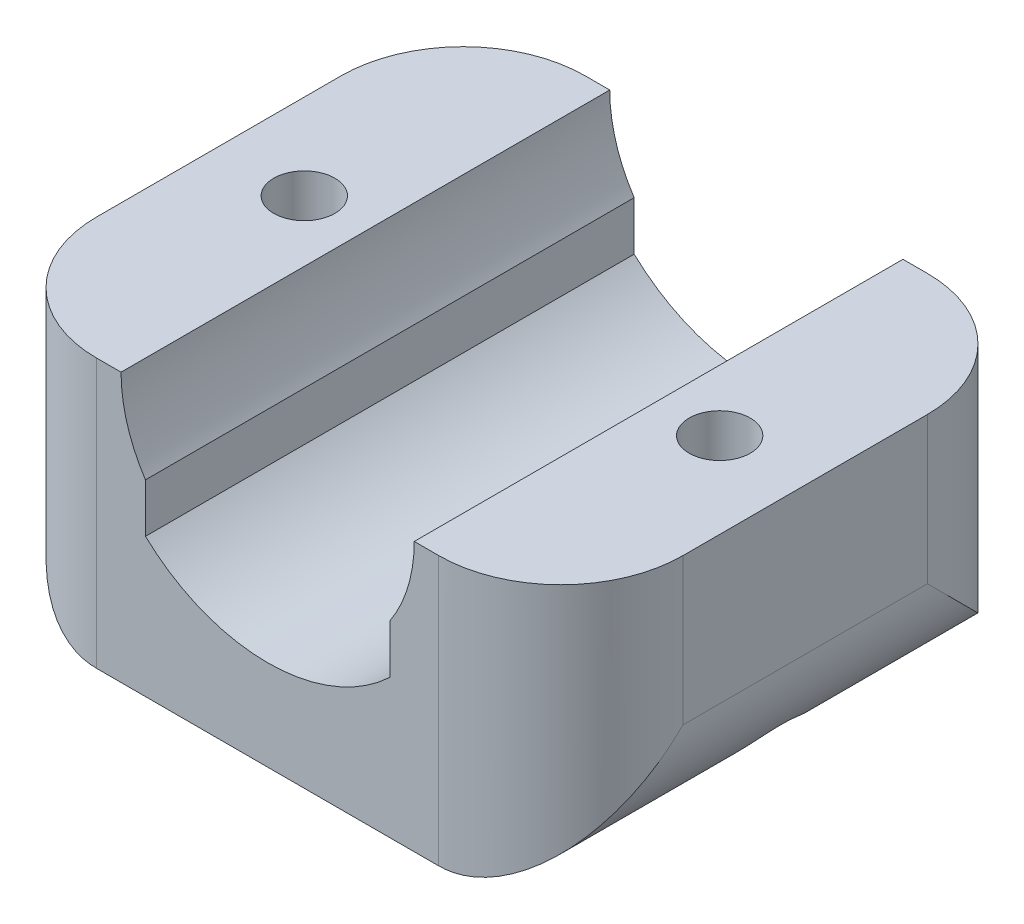
ISO-10303-21;
HEADER;
FILE_DESCRIPTION(('STEP AP214'),'2;1');
FILE_NAME('part.step','',(''),(''),'','','');
FILE_SCHEMA(('AUTOMOTIVE_DESIGN { 1 0 10303 214 1 1 1 1 }'));
ENDSEC;
DATA;
#1=APPLICATION_CONTEXT('core data for automotive mechanical design processes');
#2=APPLICATION_PROTOCOL_DEFINITION('international standard','automotive_design',2000,#1);
#3=PRODUCT_CONTEXT('',#1,'mechanical');
#4=PRODUCT('Part','Part','',(#3));
#5=PRODUCT_RELATED_PRODUCT_CATEGORY('part','',(#4));
#6=PRODUCT_DEFINITION_FORMATION('','',#4);
#7=PRODUCT_DEFINITION_CONTEXT('part definition',#1,'design');
#8=PRODUCT_DEFINITION('design','',#6,#7);
#9=PRODUCT_DEFINITION_SHAPE('','',#8);
#10=(LENGTH_UNIT() NAMED_UNIT(*) SI_UNIT(.MILLI.,.METRE.));
#11=(NAMED_UNIT(*) PLANE_ANGLE_UNIT() SI_UNIT($,.RADIAN.));
#12=(NAMED_UNIT(*) SI_UNIT($,.STERADIAN.) SOLID_ANGLE_UNIT());
#13=UNCERTAINTY_MEASURE_WITH_UNIT(LENGTH_MEASURE(1.E-05),#10,'distance_accuracy_value','');
#14=(GEOMETRIC_REPRESENTATION_CONTEXT(3) GLOBAL_UNCERTAINTY_ASSIGNED_CONTEXT((#13)) GLOBAL_UNIT_ASSIGNED_CONTEXT((#10,
#11,#12)) REPRESENTATION_CONTEXT('',''));
#15=CARTESIAN_POINT('',(0.,0.,0.));
#16=DIRECTION('',(0.,0.,1.));
#17=DIRECTION('',(1.,0.,0.));
#18=AXIS2_PLACEMENT_3D('',#15,#16,#17);
#19=CARTESIAN_POINT('',(-8.5,-17.,0.));
#20=DIRECTION('',(0.,1.,0.));
#21=DIRECTION('',(0.,0.,1.));
#22=AXIS2_PLACEMENT_3D('',#19,#20,#21);
#23=CYLINDRICAL_SURFACE('',#22,1.25);
#24=CARTESIAN_POINT('',(-8.5,0.,0.));
#25=DIRECTION('',(0.,1.,0.));
#26=DIRECTION('',(0.,0.,1.));
#27=AXIS2_PLACEMENT_3D('',#24,#25,#26);
#28=CIRCLE('',#27,1.25);
#29=CARTESIAN_POINT('',(-8.5,0.,1.25));
#30=VERTEX_POINT('',#29);
#31=EDGE_CURVE('E199',#30,#30,#28,.T.);
#32=ORIENTED_EDGE('',*,*,#31,.T.);
#33=EDGE_LOOP('',(#32));
#34=FACE_BOUND('',#33,.T.);
#35=CARTESIAN_POINT('',(-8.5,-5.,0.));
#36=DIRECTION('',(0.,-1.,0.));
#37=DIRECTION('',(1.,0.,0.));
#38=AXIS2_PLACEMENT_3D('',#35,#36,#37);
#39=CIRCLE('',#38,1.25);
#40=CARTESIAN_POINT('',(-7.25,-5.,0.));
#41=VERTEX_POINT('',#40);
#42=EDGE_CURVE('E45',#41,#41,#39,.F.);
#43=ORIENTED_EDGE('',*,*,#42,.F.);
#44=EDGE_LOOP('',(#43));
#45=FACE_BOUND('',#44,.T.);
#46=ADVANCED_FACE('F41',(#34,#45),#23,.F.);
#47=CARTESIAN_POINT('',(8.5,-17.,0.));
#48=DIRECTION('',(0.,1.,0.));
#49=DIRECTION('',(0.,0.,1.));
#50=AXIS2_PLACEMENT_3D('',#47,#48,#49);
#51=CYLINDRICAL_SURFACE('',#50,1.25);
#52=CARTESIAN_POINT('',(8.5,0.,0.));
#53=DIRECTION('',(0.,1.,0.));
#54=DIRECTION('',(0.,0.,1.));
#55=AXIS2_PLACEMENT_3D('',#52,#53,#54);
#56=CIRCLE('',#55,1.25);
#57=CARTESIAN_POINT('',(8.5,0.,1.25));
#58=VERTEX_POINT('',#57);
#59=EDGE_CURVE('E198',#58,#58,#56,.T.);
#60=ORIENTED_EDGE('',*,*,#59,.T.);
#61=EDGE_LOOP('',(#60));
#62=FACE_BOUND('',#61,.T.);
#63=CARTESIAN_POINT('',(8.5,-5.,0.));
#64=DIRECTION('',(0.,-1.,0.));
#65=DIRECTION('',(1.,0.,0.));
#66=AXIS2_PLACEMENT_3D('',#63,#64,#65);
#67=CIRCLE('',#66,1.25);
#68=CARTESIAN_POINT('',(9.75,-5.,0.));
#69=VERTEX_POINT('',#68);
#70=EDGE_CURVE('E477',#69,#69,#67,.F.);
#71=ORIENTED_EDGE('',*,*,#70,.F.);
#72=EDGE_LOOP('',(#71));
#73=FACE_BOUND('',#72,.T.);
#74=ADVANCED_FACE('F363',(#62,#73),#51,.F.);
#75=CARTESIAN_POINT('',(0.,-11.,10.));
#76=DIRECTION('',(0.,1.,0.));
#77=DIRECTION('',(-1.,0.,0.));
#78=AXIS2_PLACEMENT_3D('',#75,#76,#77);
#79=PLANE('',#78);
#80=DIRECTION('',(0.,0.,1.));
#81=VECTOR('',#80,1.);
#82=CARTESIAN_POINT('',(-7.,-11.,-10.));
#83=LINE('',#82,#81);
#84=CARTESIAN_POINT('',(-7.,-11.,2.));
#85=VERTEX_POINT('',#84);
#86=CARTESIAN_POINT('',(-7.,-11.,10.));
#87=VERTEX_POINT('',#86);
#88=EDGE_CURVE('E182',#85,#87,#83,.T.);
#89=ORIENTED_EDGE('',*,*,#88,.F.);
#90=CARTESIAN_POINT('',(-8.5,-11.,0.));
#91=DIRECTION('',(0.,-1.,0.));
#92=DIRECTION('',(1.,0.,0.));
#93=AXIS2_PLACEMENT_3D('',#90,#91,#92);
#94=CIRCLE('',#93,2.5);
#95=CARTESIAN_POINT('',(-7.,-11.,-2.));
#96=VERTEX_POINT('',#95);
#97=EDGE_CURVE('E57',#96,#85,#94,.T.);
#98=ORIENTED_EDGE('',*,*,#97,.F.);
#99=CARTESIAN_POINT('',(-7.,-11.,-10.));
#100=VERTEX_POINT('',#99);
#101=EDGE_CURVE('E176',#100,#96,#83,.T.);
#102=ORIENTED_EDGE('',*,*,#101,.F.);
#103=DIRECTION('',(1.,0.,0.));
#104=VECTOR('',#103,1.);
#105=CARTESIAN_POINT('',(0.,-11.,-10.));
#106=LINE('',#105,#104);
#107=CARTESIAN_POINT('',(7.,-11.,-10.));
#108=VERTEX_POINT('',#107);
#109=EDGE_CURVE('E235',#100,#108,#106,.T.);
#110=ORIENTED_EDGE('',*,*,#109,.T.);
#111=DIRECTION('',(0.,0.,1.));
#112=VECTOR('',#111,1.);
#113=CARTESIAN_POINT('',(7.,-11.,-10.));
#114=LINE('',#113,#112);
#115=CARTESIAN_POINT('',(7.,-11.,-2.));
#116=VERTEX_POINT('',#115);
#117=EDGE_CURVE('E168',#108,#116,#114,.T.);
#118=ORIENTED_EDGE('',*,*,#117,.T.);
#119=CARTESIAN_POINT('',(8.5,-11.,0.));
#120=DIRECTION('',(0.,-1.,0.));
#121=DIRECTION('',(1.,0.,0.));
#122=AXIS2_PLACEMENT_3D('',#119,#120,#121);
#123=CIRCLE('',#122,2.5);
#124=CARTESIAN_POINT('',(7.,-11.,2.));
#125=VERTEX_POINT('',#124);
#126=EDGE_CURVE('E64',#125,#116,#123,.T.);
#127=ORIENTED_EDGE('',*,*,#126,.F.);
#128=CARTESIAN_POINT('',(7.,-11.,10.));
#129=VERTEX_POINT('',#128);
#130=EDGE_CURVE('E165',#125,#129,#114,.T.);
#131=ORIENTED_EDGE('',*,*,#130,.T.);
#132=DIRECTION('',(1.,0.,0.));
#133=VECTOR('',#132,1.);
#134=CARTESIAN_POINT('',(0.,-11.,10.));
#135=LINE('',#134,#133);
#136=EDGE_CURVE('E236',#87,#129,#135,.T.);
#137=ORIENTED_EDGE('',*,*,#136,.F.);
#138=EDGE_LOOP('',(#89,#98,#102,#110,#118,#127,#131,#137));
#139=FACE_BOUND('',#138,.T.);
#140=ADVANCED_FACE('F163',(#139),#79,.F.);
#141=CARTESIAN_POINT('',(7.,0.,-5.));
#142=DIRECTION('',(0.,1.,0.));
#143=DIRECTION('',(-1.,0.,0.));
#144=AXIS2_PLACEMENT_3D('',#141,#142,#143);
#145=CYLINDRICAL_SURFACE('',#144,5.);
#146=DIRECTION('',(0.,-1.,0.));
#147=VECTOR('',#146,1.);
#148=CARTESIAN_POINT('',(12.,0.,-5.));
#149=LINE('',#148,#147);
#150=CARTESIAN_POINT('',(12.,-6.,-5.));
#151=VERTEX_POINT('',#150);
#152=CARTESIAN_POINT('',(12.,0.,-5.));
#153=VERTEX_POINT('',#152);
#154=EDGE_CURVE('E299',#151,#153,#149,.F.);
#155=ORIENTED_EDGE('',*,*,#154,.F.);
#156=CARTESIAN_POINT('',(7.,-6.,-5.));
#157=DIRECTION('',(0.,0.707106781186547,-0.707106781186547));
#158=DIRECTION('',(0.,0.707106781186547,0.707106781186547));
#159=AXIS2_PLACEMENT_3D('',#156,#157,#158);
#160=ELLIPSE('',#159,7.07106781186548,5.);
#161=EDGE_CURVE('E194',#151,#108,#160,.T.);
#162=ORIENTED_EDGE('',*,*,#161,.T.);
#163=DIRECTION('',(0.,-1.,0.));
#164=VECTOR('',#163,1.);
#165=CARTESIAN_POINT('',(7.,-11.,-10.));
#166=LINE('',#165,#164);
#167=CARTESIAN_POINT('',(7.,0.,-10.));
#168=VERTEX_POINT('',#167);
#169=EDGE_CURVE('E291',#168,#108,#166,.T.);
#170=ORIENTED_EDGE('',*,*,#169,.F.);
#171=CARTESIAN_POINT('',(7.,0.,-5.));
#172=DIRECTION('',(0.,1.,0.));
#173=DIRECTION('',(0.,0.,1.));
#174=AXIS2_PLACEMENT_3D('',#171,#172,#173);
#175=CIRCLE('',#174,5.);
#176=EDGE_CURVE('E305',#153,#168,#175,.T.);
#177=ORIENTED_EDGE('',*,*,#176,.F.);
#178=EDGE_LOOP('',(#155,#162,#170,#177));
#179=FACE_BOUND('',#178,.T.);
#180=ADVANCED_FACE('F418',(#179),#145,.T.);
#181=CARTESIAN_POINT('',(-7.,0.,-5.));
#182=DIRECTION('',(0.,-1.,0.));
#183=DIRECTION('',(1.,0.,0.));
#184=AXIS2_PLACEMENT_3D('',#181,#182,#183);
#185=CYLINDRICAL_SURFACE('',#184,5.);
#186=DIRECTION('',(0.,-1.,0.));
#187=VECTOR('',#186,1.);
#188=CARTESIAN_POINT('',(-7.,0.,-10.));
#189=LINE('',#188,#187);
#190=CARTESIAN_POINT('',(-7.,0.,-10.));
#191=VERTEX_POINT('',#190);
#192=EDGE_CURVE('E288',#100,#191,#189,.F.);
#193=ORIENTED_EDGE('',*,*,#192,.F.);
#194=CARTESIAN_POINT('',(-7.,-6.,-5.));
#195=DIRECTION('',(0.,-0.707106781186547,0.707106781186547));
#196=DIRECTION('',(0.,-0.707106781186547,-0.707106781186547));
#197=AXIS2_PLACEMENT_3D('',#194,#195,#196);
#198=ELLIPSE('',#197,7.07106781186547,5.);
#199=CARTESIAN_POINT('',(-12.,-6.,-5.));
#200=VERTEX_POINT('',#199);
#201=EDGE_CURVE('E190',#100,#200,#198,.F.);
#202=ORIENTED_EDGE('',*,*,#201,.T.);
#203=DIRECTION('',(0.,-1.,0.));
#204=VECTOR('',#203,1.);
#205=CARTESIAN_POINT('',(-12.,0.,-5.));
#206=LINE('',#205,#204);
#207=CARTESIAN_POINT('',(-12.,0.,-5.));
#208=VERTEX_POINT('',#207);
#209=EDGE_CURVE('E311',#208,#200,#206,.T.);
#210=ORIENTED_EDGE('',*,*,#209,.F.);
#211=CARTESIAN_POINT('',(-7.,0.,-5.));
#212=DIRECTION('',(0.,1.,0.));
#213=DIRECTION('',(0.,0.,1.));
#214=AXIS2_PLACEMENT_3D('',#211,#212,#213);
#215=CIRCLE('',#214,5.);
#216=EDGE_CURVE('E318',#191,#208,#215,.T.);
#217=ORIENTED_EDGE('',*,*,#216,.F.);
#218=EDGE_LOOP('',(#193,#202,#210,#217));
#219=FACE_BOUND('',#218,.T.);
#220=ADVANCED_FACE('F421',(#219),#185,.T.);
#221=CARTESIAN_POINT('',(7.,0.,5.));
#222=DIRECTION('',(0.,-1.,0.));
#223=DIRECTION('',(1.,0.,0.));
#224=AXIS2_PLACEMENT_3D('',#221,#222,#223);
#225=CYLINDRICAL_SURFACE('',#224,5.);
#226=DIRECTION('',(0.,-1.,0.));
#227=VECTOR('',#226,1.);
#228=CARTESIAN_POINT('',(7.,0.,10.));
#229=LINE('',#228,#227);
#230=CARTESIAN_POINT('',(7.,0.,10.));
#231=VERTEX_POINT('',#230);
#232=EDGE_CURVE('E325',#129,#231,#229,.F.);
#233=ORIENTED_EDGE('',*,*,#232,.F.);
#234=CARTESIAN_POINT('',(7.,-6.,5.));
#235=DIRECTION('',(0.,-0.707106781186547,-0.707106781186547));
#236=DIRECTION('',(0.,-0.707106781186547,0.707106781186547));
#237=AXIS2_PLACEMENT_3D('',#234,#235,#236);
#238=ELLIPSE('',#237,7.07106781186548,5.);
#239=CARTESIAN_POINT('',(12.,-6.,5.));
#240=VERTEX_POINT('',#239);
#241=EDGE_CURVE('E159',#129,#240,#238,.F.);
#242=ORIENTED_EDGE('',*,*,#241,.T.);
#243=DIRECTION('',(0.,-1.,0.));
#244=VECTOR('',#243,1.);
#245=CARTESIAN_POINT('',(12.,0.,5.));
#246=LINE('',#245,#244);
#247=CARTESIAN_POINT('',(12.,0.,5.));
#248=VERTEX_POINT('',#247);
#249=EDGE_CURVE('E295',#248,#240,#246,.T.);
#250=ORIENTED_EDGE('',*,*,#249,.F.);
#251=CARTESIAN_POINT('',(7.,0.,5.));
#252=DIRECTION('',(0.,1.,0.));
#253=DIRECTION('',(0.,0.,1.));
#254=AXIS2_PLACEMENT_3D('',#251,#252,#253);
#255=CIRCLE('',#254,5.);
#256=EDGE_CURVE('E302',#231,#248,#255,.T.);
#257=ORIENTED_EDGE('',*,*,#256,.F.);
#258=EDGE_LOOP('',(#233,#242,#250,#257));
#259=FACE_BOUND('',#258,.T.);
#260=ADVANCED_FACE('F424',(#259),#225,.T.);
#261=CARTESIAN_POINT('',(-7.,0.,5.));
#262=DIRECTION('',(0.,1.,0.));
#263=DIRECTION('',(-1.,0.,0.));
#264=AXIS2_PLACEMENT_3D('',#261,#262,#263);
#265=CYLINDRICAL_SURFACE('',#264,5.);
#266=DIRECTION('',(0.,-1.,0.));
#267=VECTOR('',#266,1.);
#268=CARTESIAN_POINT('',(-12.,0.,5.));
#269=LINE('',#268,#267);
#270=CARTESIAN_POINT('',(-12.,-6.,5.));
#271=VERTEX_POINT('',#270);
#272=CARTESIAN_POINT('',(-12.,0.,5.));
#273=VERTEX_POINT('',#272);
#274=EDGE_CURVE('E308',#271,#273,#269,.F.);
#275=ORIENTED_EDGE('',*,*,#274,.F.);
#276=CARTESIAN_POINT('',(-7.,-6.,5.));
#277=DIRECTION('',(0.,0.707106781186547,0.707106781186547));
#278=DIRECTION('',(0.,0.707106781186547,-0.707106781186547));
#279=AXIS2_PLACEMENT_3D('',#276,#277,#278);
#280=ELLIPSE('',#279,7.07106781186547,5.);
#281=EDGE_CURVE('E328',#271,#87,#280,.T.);
#282=ORIENTED_EDGE('',*,*,#281,.T.);
#283=DIRECTION('',(0.,-1.,0.));
#284=VECTOR('',#283,1.);
#285=CARTESIAN_POINT('',(-7.,-11.,10.));
#286=LINE('',#285,#284);
#287=CARTESIAN_POINT('',(-7.,0.,10.));
#288=VERTEX_POINT('',#287);
#289=EDGE_CURVE('E321',#288,#87,#286,.T.);
#290=ORIENTED_EDGE('',*,*,#289,.F.);
#291=CARTESIAN_POINT('',(-7.,0.,5.));
#292=DIRECTION('',(0.,1.,0.));
#293=DIRECTION('',(0.,0.,1.));
#294=AXIS2_PLACEMENT_3D('',#291,#292,#293);
#295=CIRCLE('',#294,5.);
#296=EDGE_CURVE('E315',#273,#288,#295,.T.);
#297=ORIENTED_EDGE('',*,*,#296,.F.);
#298=EDGE_LOOP('',(#275,#282,#290,#297));
#299=FACE_BOUND('',#298,.T.);
#300=ADVANCED_FACE('F43',(#299),#265,.T.);
#301=CARTESIAN_POINT('',(0.,0.,10.));
#302=DIRECTION('',(0.,0.,-1.));
#303=DIRECTION('',(-1.,0.,0.));
#304=AXIS2_PLACEMENT_3D('',#301,#302,#303);
#305=CYLINDRICAL_SURFACE('',#304,6.);
#306=CARTESIAN_POINT('',(0.,0.,-10.));
#307=DIRECTION('',(0.,0.,1.));
#308=DIRECTION('',(1.,0.,0.));
#309=AXIS2_PLACEMENT_3D('',#306,#307,#308);
#310=CIRCLE('',#309,6.);
#311=CARTESIAN_POINT('',(5.,-3.3166247903554,-10.));
#312=VERTEX_POINT('',#311);
#313=CARTESIAN_POINT('',(6.,0.,-10.));
#314=VERTEX_POINT('',#313);
#315=EDGE_CURVE('E259',#312,#314,#310,.T.);
#316=ORIENTED_EDGE('',*,*,#315,.F.);
#317=DIRECTION('',(0.,0.,-1.));
#318=VECTOR('',#317,1.);
#319=CARTESIAN_POINT('',(5.,-3.3166247903554,10.));
#320=LINE('',#319,#318);
#321=CARTESIAN_POINT('',(5.,-3.3166247903554,10.));
#322=VERTEX_POINT('',#321);
#323=EDGE_CURVE('E226',#312,#322,#320,.F.);
#324=ORIENTED_EDGE('',*,*,#323,.T.);
#325=CARTESIAN_POINT('',(0.,0.,10.));
#326=DIRECTION('',(0.,0.,1.));
#327=DIRECTION('',(1.,0.,0.));
#328=AXIS2_PLACEMENT_3D('',#325,#326,#327);
#329=CIRCLE('',#328,6.);
#330=CARTESIAN_POINT('',(6.,0.,10.));
#331=VERTEX_POINT('',#330);
#332=EDGE_CURVE('E244',#322,#331,#329,.T.);
#333=ORIENTED_EDGE('',*,*,#332,.T.);
#334=DIRECTION('',(0.,0.,-1.));
#335=VECTOR('',#334,1.);
#336=CARTESIAN_POINT('',(6.,0.,10.));
#337=LINE('',#336,#335);
#338=EDGE_CURVE('E273',#331,#314,#337,.T.);
#339=ORIENTED_EDGE('',*,*,#338,.T.);
#340=EDGE_LOOP('',(#316,#324,#333,#339));
#341=FACE_BOUND('',#340,.T.);
#342=ADVANCED_FACE('F408',(#341),#305,.F.);
#343=CARTESIAN_POINT('',(12.,0.,10.));
#344=DIRECTION('',(1.,0.,0.));
#345=DIRECTION('',(0.,1.,0.));
#346=AXIS2_PLACEMENT_3D('',#343,#344,#345);
#347=PLANE('',#346);
#348=DIRECTION('',(0.,0.,1.));
#349=VECTOR('',#348,1.);
#350=CARTESIAN_POINT('',(12.,-6.,-10.));
#351=LINE('',#350,#349);
#352=EDGE_CURVE('E180',#151,#240,#351,.T.);
#353=ORIENTED_EDGE('',*,*,#352,.F.);
#354=ORIENTED_EDGE('',*,*,#154,.T.);
#355=DIRECTION('',(0.,0.,-1.));
#356=VECTOR('',#355,1.);
#357=CARTESIAN_POINT('',(12.,0.,10.));
#358=LINE('',#357,#356);
#359=EDGE_CURVE('E277',#248,#153,#358,.T.);
#360=ORIENTED_EDGE('',*,*,#359,.F.);
#361=ORIENTED_EDGE('',*,*,#249,.T.);
#362=EDGE_LOOP('',(#353,#354,#360,#361));
#363=FACE_BOUND('',#362,.T.);
#364=ADVANCED_FACE('F411',(#363),#347,.T.);
#365=CARTESIAN_POINT('',(0.,0.,10.));
#366=DIRECTION('',(0.,1.,0.));
#367=DIRECTION('',(0.,0.,1.));
#368=AXIS2_PLACEMENT_3D('',#365,#366,#367);
#369=PLANE('',#368);
#370=ORIENTED_EDGE('',*,*,#59,.F.);
#371=EDGE_LOOP('',(#370));
#372=FACE_BOUND('',#371,.T.);
#373=ORIENTED_EDGE('',*,*,#359,.T.);
#374=ORIENTED_EDGE('',*,*,#176,.T.);
#375=DIRECTION('',(1.,0.,0.));
#376=VECTOR('',#375,1.);
#377=CARTESIAN_POINT('',(0.,0.,-10.));
#378=LINE('',#377,#376);
#379=EDGE_CURVE('E255',#314,#168,#378,.T.);
#380=ORIENTED_EDGE('',*,*,#379,.F.);
#381=ORIENTED_EDGE('',*,*,#338,.F.);
#382=DIRECTION('',(1.,0.,0.));
#383=VECTOR('',#382,1.);
#384=CARTESIAN_POINT('',(0.,0.,10.));
#385=LINE('',#384,#383);
#386=EDGE_CURVE('E239',#331,#231,#385,.T.);
#387=ORIENTED_EDGE('',*,*,#386,.T.);
#388=ORIENTED_EDGE('',*,*,#256,.T.);
#389=EDGE_LOOP('',(#373,#374,#380,#381,#387,#388));
#390=FACE_BOUND('',#389,.T.);
#391=ADVANCED_FACE('F406',(#372,#390),#369,.T.);
#392=DIRECTION('',(0.,0.,-1.));
#393=VECTOR('',#392,1.);
#394=CARTESIAN_POINT('',(-5.,-3.31662479035541,10.));
#395=LINE('',#394,#393);
#396=CARTESIAN_POINT('',(-5.,-3.31662479035541,-10.));
#397=VERTEX_POINT('',#396);
#398=CARTESIAN_POINT('',(-5.,-3.31662479035541,10.));
#399=VERTEX_POINT('',#398);
#400=EDGE_CURVE('E232',#397,#399,#395,.F.);
#401=ORIENTED_EDGE('',*,*,#400,.F.);
#402=CARTESIAN_POINT('',(-6.00000000000001,0.,-10.));
#403=VERTEX_POINT('',#402);
#404=EDGE_CURVE('E260',#403,#397,#310,.T.);
#405=ORIENTED_EDGE('',*,*,#404,.F.);
#406=DIRECTION('',(0.,0.,-1.));
#407=VECTOR('',#406,1.);
#408=CARTESIAN_POINT('',(-6.00000000000001,0.,10.));
#409=LINE('',#408,#407);
#410=CARTESIAN_POINT('',(-6.00000000000001,0.,10.));
#411=VERTEX_POINT('',#410);
#412=EDGE_CURVE('E269',#411,#403,#409,.T.);
#413=ORIENTED_EDGE('',*,*,#412,.F.);
#414=EDGE_CURVE('E245',#411,#399,#329,.T.);
#415=ORIENTED_EDGE('',*,*,#414,.T.);
#416=EDGE_LOOP('',(#401,#405,#413,#415));
#417=FACE_BOUND('',#416,.T.);
#418=ADVANCED_FACE('F402',(#417),#305,.F.);
#419=CARTESIAN_POINT('',(0.,0.,10.));
#420=DIRECTION('',(0.,1.,0.));
#421=DIRECTION('',(0.,0.,1.));
#422=AXIS2_PLACEMENT_3D('',#419,#420,#421);
#423=PLANE('',#422);
#424=ORIENTED_EDGE('',*,*,#31,.F.);
#425=EDGE_LOOP('',(#424));
#426=FACE_BOUND('',#425,.T.);
#427=DIRECTION('',(1.,0.,0.));
#428=VECTOR('',#427,1.);
#429=CARTESIAN_POINT('',(0.,0.,-10.));
#430=LINE('',#429,#428);
#431=EDGE_CURVE('E240',#191,#403,#430,.T.);
#432=ORIENTED_EDGE('',*,*,#431,.F.);
#433=ORIENTED_EDGE('',*,*,#216,.T.);
#434=DIRECTION('',(0.,0.,-1.));
#435=VECTOR('',#434,1.);
#436=CARTESIAN_POINT('',(-12.,0.,10.));
#437=LINE('',#436,#435);
#438=EDGE_CURVE('E252',#273,#208,#437,.T.);
#439=ORIENTED_EDGE('',*,*,#438,.F.);
#440=ORIENTED_EDGE('',*,*,#296,.T.);
#441=DIRECTION('',(1.,0.,0.));
#442=VECTOR('',#441,1.);
#443=CARTESIAN_POINT('',(0.,0.,10.));
#444=LINE('',#443,#442);
#445=EDGE_CURVE('E249',#288,#411,#444,.T.);
#446=ORIENTED_EDGE('',*,*,#445,.T.);
#447=ORIENTED_EDGE('',*,*,#412,.T.);
#448=EDGE_LOOP('',(#432,#433,#439,#440,#446,#447));
#449=FACE_BOUND('',#448,.T.);
#450=ADVANCED_FACE('F398',(#426,#449),#423,.T.);
#451=CARTESIAN_POINT('',(-12.,0.,10.));
#452=DIRECTION('',(1.,0.,0.));
#453=DIRECTION('',(0.,1.,0.));
#454=AXIS2_PLACEMENT_3D('',#451,#452,#453);
#455=PLANE('',#454);
#456=ORIENTED_EDGE('',*,*,#209,.T.);
#457=DIRECTION('',(0.,0.,1.));
#458=VECTOR('',#457,1.);
#459=CARTESIAN_POINT('',(-12.,-6.,-10.));
#460=LINE('',#459,#458);
#461=EDGE_CURVE('E186',#200,#271,#460,.T.);
#462=ORIENTED_EDGE('',*,*,#461,.T.);
#463=ORIENTED_EDGE('',*,*,#274,.T.);
#464=ORIENTED_EDGE('',*,*,#438,.T.);
#465=EDGE_LOOP('',(#456,#462,#463,#464));
#466=FACE_BOUND('',#465,.T.);
#467=ADVANCED_FACE('F391',(#466),#455,.F.);
#468=CARTESIAN_POINT('',(0.,0.,10.));
#469=DIRECTION('',(0.,0.,1.));
#470=DIRECTION('',(1.,0.,0.));
#471=AXIS2_PLACEMENT_3D('',#468,#469,#470);
#472=PLANE('',#471);
#473=ORIENTED_EDGE('',*,*,#136,.T.);
#474=ORIENTED_EDGE('',*,*,#232,.T.);
#475=ORIENTED_EDGE('',*,*,#386,.F.);
#476=ORIENTED_EDGE('',*,*,#332,.F.);
#477=DIRECTION('',(0.,-1.,0.));
#478=VECTOR('',#477,1.);
#479=CARTESIAN_POINT('',(5.,0.,10.));
#480=LINE('',#479,#478);
#481=CARTESIAN_POINT('',(5.,-5.31883445878889,10.));
#482=VERTEX_POINT('',#481);
#483=EDGE_CURVE('E210',#322,#482,#480,.T.);
#484=ORIENTED_EDGE('',*,*,#483,.T.);
#485=CARTESIAN_POINT('',(0.,0.,10.));
#486=DIRECTION('',(0.,0.,1.));
#487=DIRECTION('',(1.,0.,0.));
#488=AXIS2_PLACEMENT_3D('',#485,#486,#487);
#489=CIRCLE('',#488,7.30000000000001);
#490=CARTESIAN_POINT('',(-5.,-5.31883445878889,10.));
#491=VERTEX_POINT('',#490);
#492=EDGE_CURVE('E203',#491,#482,#489,.T.);
#493=ORIENTED_EDGE('',*,*,#492,.F.);
#494=DIRECTION('',(0.,-1.,0.));
#495=VECTOR('',#494,1.);
#496=CARTESIAN_POINT('',(-5.,0.,10.));
#497=LINE('',#496,#495);
#498=EDGE_CURVE('E214',#399,#491,#497,.T.);
#499=ORIENTED_EDGE('',*,*,#498,.F.);
#500=ORIENTED_EDGE('',*,*,#414,.F.);
#501=ORIENTED_EDGE('',*,*,#445,.F.);
#502=ORIENTED_EDGE('',*,*,#289,.T.);
#503=EDGE_LOOP('',(#473,#474,#475,#476,#484,#493,#499,#500,#501,#502));
#504=FACE_BOUND('',#503,.T.);
#505=ADVANCED_FACE('F388',(#504),#472,.T.);
#506=CARTESIAN_POINT('',(0.,0.,-10.));
#507=DIRECTION('',(0.,0.,1.));
#508=DIRECTION('',(1.,0.,0.));
#509=AXIS2_PLACEMENT_3D('',#506,#507,#508);
#510=PLANE('',#509);
#511=ORIENTED_EDGE('',*,*,#379,.T.);
#512=ORIENTED_EDGE('',*,*,#169,.T.);
#513=ORIENTED_EDGE('',*,*,#109,.F.);
#514=ORIENTED_EDGE('',*,*,#192,.T.);
#515=ORIENTED_EDGE('',*,*,#431,.T.);
#516=ORIENTED_EDGE('',*,*,#404,.T.);
#517=DIRECTION('',(0.,-1.,0.));
#518=VECTOR('',#517,1.);
#519=CARTESIAN_POINT('',(-5.,0.,-10.));
#520=LINE('',#519,#518);
#521=CARTESIAN_POINT('',(-5.,-5.31883445878889,-10.));
#522=VERTEX_POINT('',#521);
#523=EDGE_CURVE('E284',#397,#522,#520,.T.);
#524=ORIENTED_EDGE('',*,*,#523,.T.);
#525=CARTESIAN_POINT('',(0.,0.,-10.));
#526=DIRECTION('',(0.,0.,1.));
#527=DIRECTION('',(1.,0.,0.));
#528=AXIS2_PLACEMENT_3D('',#525,#526,#527);
#529=CIRCLE('',#528,7.30000000000001);
#530=CARTESIAN_POINT('',(5.,-5.31883445878889,-10.));
#531=VERTEX_POINT('',#530);
#532=EDGE_CURVE('E217',#522,#531,#529,.T.);
#533=ORIENTED_EDGE('',*,*,#532,.T.);
#534=DIRECTION('',(0.,-1.,0.));
#535=VECTOR('',#534,1.);
#536=CARTESIAN_POINT('',(5.,0.,-10.));
#537=LINE('',#536,#535);
#538=EDGE_CURVE('E281',#312,#531,#537,.T.);
#539=ORIENTED_EDGE('',*,*,#538,.F.);
#540=ORIENTED_EDGE('',*,*,#315,.T.);
#541=EDGE_LOOP('',(#511,#512,#513,#514,#515,#516,#524,#533,#539,#540));
#542=FACE_BOUND('',#541,.T.);
#543=ADVANCED_FACE('F386',(#542),#510,.F.);
#544=CARTESIAN_POINT('',(0.,0.,-10.));
#545=DIRECTION('',(0.,0.,1.));
#546=DIRECTION('',(1.,0.,0.));
#547=AXIS2_PLACEMENT_3D('',#544,#545,#546);
#548=CYLINDRICAL_SURFACE('',#547,7.30000000000001);
#549=DIRECTION('',(0.,0.,1.));
#550=VECTOR('',#549,1.);
#551=CARTESIAN_POINT('',(5.,-5.31883445878889,-10.));
#552=LINE('',#551,#550);
#553=EDGE_CURVE('E221',#531,#482,#552,.T.);
#554=ORIENTED_EDGE('',*,*,#553,.F.);
#555=ORIENTED_EDGE('',*,*,#532,.F.);
#556=DIRECTION('',(0.,0.,1.));
#557=VECTOR('',#556,1.);
#558=CARTESIAN_POINT('',(-5.,-5.31883445878889,-10.));
#559=LINE('',#558,#557);
#560=EDGE_CURVE('E222',#522,#491,#559,.T.);
#561=ORIENTED_EDGE('',*,*,#560,.T.);
#562=ORIENTED_EDGE('',*,*,#492,.T.);
#563=EDGE_LOOP('',(#554,#555,#561,#562));
#564=FACE_BOUND('',#563,.T.);
#565=ADVANCED_FACE('F379',(#564),#548,.F.);
#566=CARTESIAN_POINT('',(-5.,0.,-10.));
#567=DIRECTION('',(-1.,0.,0.));
#568=DIRECTION('',(0.,-1.,0.));
#569=AXIS2_PLACEMENT_3D('',#566,#567,#568);
#570=PLANE('',#569);
#571=ORIENTED_EDGE('',*,*,#400,.T.);
#572=ORIENTED_EDGE('',*,*,#498,.T.);
#573=ORIENTED_EDGE('',*,*,#560,.F.);
#574=ORIENTED_EDGE('',*,*,#523,.F.);
#575=EDGE_LOOP('',(#571,#572,#573,#574));
#576=FACE_BOUND('',#575,.T.);
#577=ADVANCED_FACE('F375',(#576),#570,.F.);
#578=CARTESIAN_POINT('',(5.,0.,-10.));
#579=DIRECTION('',(-1.,0.,0.));
#580=DIRECTION('',(0.,-1.,0.));
#581=AXIS2_PLACEMENT_3D('',#578,#579,#580);
#582=PLANE('',#581);
#583=ORIENTED_EDGE('',*,*,#538,.T.);
#584=ORIENTED_EDGE('',*,*,#553,.T.);
#585=ORIENTED_EDGE('',*,*,#483,.F.);
#586=ORIENTED_EDGE('',*,*,#323,.F.);
#587=EDGE_LOOP('',(#583,#584,#585,#586));
#588=FACE_BOUND('',#587,.T.);
#589=ADVANCED_FACE('F378',(#588),#582,.T.);
#590=CARTESIAN_POINT('',(-7.,-6.,-10.));
#591=DIRECTION('',(0.,0.,1.));
#592=DIRECTION('',(1.,0.,0.));
#593=AXIS2_PLACEMENT_3D('',#590,#591,#592);
#594=CYLINDRICAL_SURFACE('',#593,5.);
#595=CARTESIAN_POINT('',(-6.,-10.8989794855664,0.));
#596=CARTESIAN_POINT('',(-6.00001240880643,-10.898990349908,0.139311341757047));
#597=CARTESIAN_POINT('',(-6.01170055312287,-10.9014137058011,0.278833029762772));
#598=CARTESIAN_POINT('',(-6.05816158276784,-10.9105467332832,0.554078139556445));
#599=CARTESIAN_POINT('',(-6.09299415161579,-10.917267485059,0.689790793319813));
#600=CARTESIAN_POINT('',(-6.18463966608816,-10.9332885795721,0.953151005629946));
#601=CARTESIAN_POINT('',(-6.24141241721783,-10.9425841963777,1.08081281874082));
#602=CARTESIAN_POINT('',(-6.37535497592527,-10.9612871467069,1.32486211996319));
#603=CARTESIAN_POINT('',(-6.45251705679798,-10.9706944366241,1.44125385618016));
#604=CARTESIAN_POINT('',(-6.62628576053734,-10.9867849838952,1.661038082338));
#605=CARTESIAN_POINT('',(-6.72311432855535,-10.9934342448183,1.76425807043502));
#606=CARTESIAN_POINT('',(-6.9329335311976,-11.000648852814,1.95299684287357));
#607=CARTESIAN_POINT('',(-7.0459206120001,-11.0012155355795,2.03851950938083));
#608=CARTESIAN_POINT('',(-7.28075945811185,-10.9934478100021,2.18680656410851));
#609=CARTESIAN_POINT('',(-7.40222113865933,-10.9853925220975,2.25020160294474));
#610=CARTESIAN_POINT('',(-7.6528543882981,-10.9587924971477,2.35601906181887));
#611=CARTESIAN_POINT('',(-7.78202218935714,-10.940252849602,2.39845163910685));
#612=CARTESIAN_POINT('',(-8.0360733813109,-10.8930875161955,2.45985640501506));
#613=CARTESIAN_POINT('',(-8.16078966722428,-10.8650871270103,2.48001290075555));
#614=CARTESIAN_POINT('',(-8.409152879684,-10.799042182315,2.50145782522956));
#615=CARTESIAN_POINT('',(-8.53279965874456,-10.7609962636253,2.50274369187565));
#616=CARTESIAN_POINT('',(-8.77830535409396,-10.6749240060681,2.48756899159196));
#617=CARTESIAN_POINT('',(-8.90007221742096,-10.6267048811068,2.47073523447325));
#618=CARTESIAN_POINT('',(-9.13657188824794,-10.5223663494222,2.42062132715019));
#619=CARTESIAN_POINT('',(-9.25130266601976,-10.4662446782654,2.38733645607892));
#620=CARTESIAN_POINT('',(-9.48658525681096,-10.3401554741616,2.3009450713213));
#621=CARTESIAN_POINT('',(-9.60593371984937,-10.2693371322942,2.24581449449765));
#622=CARTESIAN_POINT('',(-9.83234727556249,-10.1226292608288,2.11936429447291));
#623=CARTESIAN_POINT('',(-9.93939815602415,-10.0467340209727,2.0480262182396));
#624=CARTESIAN_POINT('',(-10.1593307272283,-9.8782921556305,1.87606038515568));
#625=CARTESIAN_POINT('',(-10.2695598353326,-9.78528552397167,1.77245011875454));
#626=CARTESIAN_POINT('',(-10.4202350799141,-9.64782864536581,1.60262826147752));
#627=CARTESIAN_POINT('',(-10.4680302702158,-9.60233554550501,1.54359558727726));
#628=CARTESIAN_POINT('',(-10.558541833418,-9.51294972511398,1.42064412925014));
#629=CARTESIAN_POINT('',(-10.6012602095284,-9.46905637812483,1.35672728908409));
#630=CARTESIAN_POINT('',(-10.6960893958603,-9.36827805118307,1.19936613771494));
#631=CARTESIAN_POINT('',(-10.7458584116982,-9.31256785524164,1.10372202197737));
#632=CARTESIAN_POINT('',(-10.8338810222359,-9.21028045887098,0.902764176595204));
#633=CARTESIAN_POINT('',(-10.8721571763525,-9.16368542974095,0.797469926910753));
#634=CARTESIAN_POINT('',(-10.9277280436345,-9.09426279494529,0.603178483152894));
#635=CARTESIAN_POINT('',(-10.9478321163115,-9.06842785769518,0.516086500110959));
#636=CARTESIAN_POINT('',(-10.9787308975419,-9.02825966429361,0.337714975569648));
#637=CARTESIAN_POINT('',(-10.9895403928955,-9.01390814164262,0.246442329723589));
#638=CARTESIAN_POINT('',(-11.0009663294563,-8.99872875944689,0.0615232171249996));
#639=CARTESIAN_POINT('',(-11.0015203110957,-8.99798376867892,-0.0321343189851046));
#640=CARTESIAN_POINT('',(-10.9922183180187,-9.01035566175914,-0.218014705952231));
#641=CARTESIAN_POINT('',(-10.9823542469209,-9.02348332673495,-0.310236384374961));
#642=CARTESIAN_POINT('',(-10.9507724153678,-9.06466170238549,-0.504918413969941));
#643=CARTESIAN_POINT('',(-10.9274143457374,-9.09475939539772,-0.606664390358979));
#644=CARTESIAN_POINT('',(-10.8698234001234,-9.16647718475853,-0.802771756515355));
#645=CARTESIAN_POINT('',(-10.8355638143303,-9.2081255488806,-0.897114291810975));
#646=CARTESIAN_POINT('',(-10.7385003585177,-9.32137538249195,-1.12287135764973));
#647=CARTESIAN_POINT('',(-10.6699659339909,-9.3975895086528,-1.24947417631326));
#648=CARTESIAN_POINT('',(-10.5153211604001,-9.55738350694755,-1.48610108505465));
#649=CARTESIAN_POINT('',(-10.4291834157839,-9.64097474324295,-1.59609886352543));
#650=CARTESIAN_POINT('',(-10.2366376627906,-9.81334342442814,-1.80416424519676));
#651=CARTESIAN_POINT('',(-10.1295190419163,-9.9021895852559,-1.90151835418947));
#652=CARTESIAN_POINT('',(-9.89856144057648,-10.0766728489373,-2.07726646860303));
#653=CARTESIAN_POINT('',(-9.77473927147571,-10.1623130691183,-2.15567931891767));
#654=CARTESIAN_POINT('',(-9.5222930480201,-10.3195268203275,-2.28546823184259));
#655=CARTESIAN_POINT('',(-9.39490649954316,-10.3916779677783,-2.3385403412762));
#656=CARTESIAN_POINT('',(-9.12850998620972,-10.5267693947459,-2.42372826217556));
#657=CARTESIAN_POINT('',(-8.98950327608766,-10.589712239957,-2.45584991969103));
#658=CARTESIAN_POINT('',(-8.77433920273976,-10.6752326253119,-2.48597399057502));
#659=CARTESIAN_POINT('',(-8.7011530544848,-10.7023621009935,-2.49299548513923));
#660=CARTESIAN_POINT('',(-8.55330226629385,-10.7532457897298,-2.50052556707012));
#661=CARTESIAN_POINT('',(-8.47863842285785,-10.7770017675779,-2.50103757227936));
#662=CARTESIAN_POINT('',(-8.32855013813082,-10.820898647913,-2.49524341990937));
#663=CARTESIAN_POINT('',(-8.25312611206262,-10.8410414217718,-2.48894080375538));
#664=CARTESIAN_POINT('',(-8.10231259555749,-10.8775957507069,-2.46933921429156));
#665=CARTESIAN_POINT('',(-8.02692310151169,-10.8940079073314,-2.456041370084));
#666=CARTESIAN_POINT('',(-7.82287796811502,-10.9335654154751,-2.41017534605336));
#667=CARTESIAN_POINT('',(-7.69498834819088,-10.9530396874492,-2.370626054164));
#668=CARTESIAN_POINT('',(-7.44631468100954,-10.9816182027196,-2.27105958404499));
#669=CARTESIAN_POINT('',(-7.32552969568504,-10.9907238179794,-2.21104511509973));
#670=CARTESIAN_POINT('',(-7.10018406971167,-11.0002117384963,-2.07533875763591));
#671=CARTESIAN_POINT('',(-6.99513743731881,-11.000968872474,-2.00047579954531));
#672=CARTESIAN_POINT('',(-6.79788329939683,-10.9968888779731,-1.83557477447137));
#673=CARTESIAN_POINT('',(-6.70567679034307,-10.9920513155812,-1.74553553090883));
#674=CARTESIAN_POINT('',(-6.53196657178356,-10.9788479602298,-1.54759597667148));
#675=CARTESIAN_POINT('',(-6.45124513653729,-10.9703153233406,-1.43902041353192));
#676=CARTESIAN_POINT('',(-6.3083131026536,-10.9524516433495,-1.2102537672687));
#677=CARTESIAN_POINT('',(-6.24611720078163,-10.9431199738705,-1.09005356163114));
#678=CARTESIAN_POINT('',(-6.13960915451157,-10.9257263187307,-0.835696587925688));
#679=CARTESIAN_POINT('',(-6.0961897525625,-10.9177369638789,-0.701160594518656));
#680=CARTESIAN_POINT('',(-6.03269307129331,-10.9056494341513,-0.426765749141971));
#681=CARTESIAN_POINT('',(-6.01255516277144,-10.9015411573805,-0.286921706837281));
#682=CARTESIAN_POINT('',(-6.00142942965247,-10.8992690143617,-0.0977596848394434));
#683=CARTESIAN_POINT('',(-5.99999564499742,-10.8989756726101,-0.0488927969475885));
#684=CARTESIAN_POINT('',(-6.,-10.8989794855664,0.));
#685=B_SPLINE_CURVE_WITH_KNOTS('',3,(#595,#596,#597,#598,#599,#600,#601,#602,#603,#604,#605,
#606,#607,#608,#609,#610,#611,#612,#613,#614,#615,#616,#617,#618,#619,#620,#621,#622,#623,#624,
#625,#626,#627,#628,#629,#630,#631,#632,#633,#634,#635,#636,#637,#638,#639,#640,#641,#642,#643,
#644,#645,#646,#647,#648,#649,#650,#651,#652,#653,#654,#655,#656,#657,#658,#659,#660,#661,#662,
#663,#664,#665,#666,#667,#668,#669,#670,#671,#672,#673,#674,#675,#676,#677,#678,#679,#680,#681,
#682,#683,#684),.UNSPECIFIED.,.T.,.F.,(4,2,2,2,2,2,2,2,2,2,2,2,2,2,2,2,2,2,2,2,2,2,2,2,2,2,2,2,
2,2,2,2,2,2,2,2,2,2,2,2,2,2,2,2,4),(0.,0.417796737257355,0.836675068059837,1.25478962246412,
1.67274595557451,2.09571116026543,2.51858348277798,2.92816879468749,3.33755544906228,
3.72393777064886,4.1103725513309,4.504921333886,4.89958340327893,5.34589750239911,
5.79272232140085,6.32309661374619,6.58847861950714,6.85375556067082,7.21681205085977,
7.57915116479016,7.85721910710897,8.13484384657397,8.41415886262486,8.6936911079505,
9.01782769434348,9.34276464333435,9.82881078417396,10.3156191854264,10.8232945472539,
11.3304627167807,11.7958179471208,12.2610432683277,12.4958482072288,12.7305298554335,
12.9650896027751,13.1996115013554,13.6031405769421,14.0066162520202,14.3918988324686,
14.7772112966558,15.1821095393261,15.5873281474817,16.010123455365,16.4318152302003,
16.5784454383546),.UNSPECIFIED.);
#686=EDGE_CURVE('E11',#85,#96,#685,.T.);
#687=ORIENTED_EDGE('',*,*,#686,.F.);
#688=ORIENTED_EDGE('',*,*,#88,.T.);
#689=ORIENTED_EDGE('',*,*,#281,.F.);
#690=ORIENTED_EDGE('',*,*,#461,.F.);
#691=ORIENTED_EDGE('',*,*,#201,.F.);
#692=ORIENTED_EDGE('',*,*,#101,.T.);
#693=EDGE_LOOP('',(#687,#688,#689,#690,#691,#692));
#694=FACE_BOUND('',#693,.T.);
#695=ADVANCED_FACE('F372',(#694),#594,.T.);
#696=CARTESIAN_POINT('',(7.,-6.,-10.));
#697=DIRECTION('',(0.,0.,1.));
#698=DIRECTION('',(1.,0.,0.));
#699=AXIS2_PLACEMENT_3D('',#696,#697,#698);
#700=CYLINDRICAL_SURFACE('',#699,5.);
#701=CARTESIAN_POINT('',(7.,-11.,-2.));
#702=CARTESIAN_POINT('',(7.05192847590337,-11.0000052912778,-2.03895682775875));
#703=CARTESIAN_POINT('',(7.10538751556642,-10.9991911211623,-2.07588004596838));
#704=CARTESIAN_POINT('',(7.21497642198424,-10.9956759089397,-2.14544090482412));
#705=CARTESIAN_POINT('',(7.27110671146985,-10.9929745672522,-2.17807786406775));
#706=CARTESIAN_POINT('',(7.38554963579049,-10.9854422636034,-2.23879212879681));
#707=CARTESIAN_POINT('',(7.44385905339981,-10.9806143358172,-2.2668758529362));
#708=CARTESIAN_POINT('',(7.56225420003801,-10.9686437329971,-2.31836303293589));
#709=CARTESIAN_POINT('',(7.62233976325487,-10.96150127342,-2.34176692410791));
#710=CARTESIAN_POINT('',(7.80476748724105,-10.93633010234,-2.40482209383965));
#711=CARTESIAN_POINT('',(7.92919388461411,-10.9145627002409,-2.43727108569359));
#712=CARTESIAN_POINT('',(8.17919198256242,-10.8606461983143,-2.48258909620315));
#713=CARTESIAN_POINT('',(8.30476314141851,-10.8285017840589,-2.49546693694482));
#714=CARTESIAN_POINT('',(8.55289142924179,-10.7544941301033,-2.50250646049037));
#715=CARTESIAN_POINT('',(8.67545945100652,-10.7126746017645,-2.49675085174378));
#716=CARTESIAN_POINT('',(8.91525899191567,-10.6204246212093,-2.46823170135073));
#717=CARTESIAN_POINT('',(9.03248692272435,-10.5699884840001,-2.44545689723607));
#718=CARTESIAN_POINT('',(9.27078857498691,-10.4567482046147,-2.3817172516284));
#719=CARTESIAN_POINT('',(9.39108686736451,-10.3932130765852,-2.33916973237982));
#720=CARTESIAN_POINT('',(9.62105638159587,-10.2600186946222,-2.23808704092454));
#721=CARTESIAN_POINT('',(9.73072236817588,-10.1903564556152,-2.17954404628123));
#722=CARTESIAN_POINT('',(9.9572261410304,-10.0344687041498,-2.03654714794939));
#723=CARTESIAN_POINT('',(10.0718156900311,-9.94751517243401,-1.94932818565222));
#724=CARTESIAN_POINT('',(10.2842323836726,-9.77263073709297,-1.75700981686881));
#725=CARTESIAN_POINT('',(10.3820431484115,-9.68469896663397,-1.65189313532687));
#726=CARTESIAN_POINT('',(10.548093044804,-9.52456387029654,-1.43912339981194));
#727=CARTESIAN_POINT('',(10.6185265376259,-9.45180729370212,-1.33359900671895));
#728=CARTESIAN_POINT('',(10.7443285659576,-9.31490276067074,-1.10883737985361));
#729=CARTESIAN_POINT('',(10.7997282340666,-9.25073715560818,-0.989629223259502));
#730=CARTESIAN_POINT('',(10.8774489331627,-9.15718589217818,-0.778409466684271));
#731=CARTESIAN_POINT('',(10.9046641670603,-9.12328533694173,-0.690230014667447));
#732=CARTESIAN_POINT('',(10.9495997805758,-9.0662653605413,-0.508152903854346));
#733=CARTESIAN_POINT('',(10.9673362235072,-9.04312770861295,-0.414265221304708));
#734=CARTESIAN_POINT('',(10.9920685722585,-9.01062121042046,-0.221584222757455));
#735=CARTESIAN_POINT('',(10.9989485162564,-9.00140106622166,-0.12274942500127));
#736=CARTESIAN_POINT('',(11.0008257094935,-8.99889995411427,0.075234203562604));
#737=CARTESIAN_POINT('',(10.9958258792581,-9.005615068679,0.174382951204274));
#738=CARTESIAN_POINT('',(10.9759694844651,-9.0318093767123,0.356100147488134));
#739=CARTESIAN_POINT('',(10.962524493705,-9.04945631351477,0.439109153124507));
#740=CARTESIAN_POINT('',(10.928084132767,-9.09369397920016,0.601057792389835));
#741=CARTESIAN_POINT('',(10.9070825777815,-9.12029203313088,0.679994031901331));
#742=CARTESIAN_POINT('',(10.8432583999548,-9.19894539762964,0.881033035332374));
#743=CARTESIAN_POINT('',(10.7950051663409,-9.25651491271175,0.999232640050022));
#744=CARTESIAN_POINT('',(10.6840063932458,-9.38158619069667,1.22303103630089));
#745=CARTESIAN_POINT('',(10.6212148479006,-9.44911923129433,1.32858817751493));
#746=CARTESIAN_POINT('',(10.5050468705086,-9.56638937468628,1.49550359517848));
#747=CARTESIAN_POINT('',(10.4551068275221,-9.61488978251151,1.56018173020751));
#748=CARTESIAN_POINT('',(10.3495618343927,-9.71289872428497,1.68396629006396));
#749=CARTESIAN_POINT('',(10.2939550659283,-9.76240757771694,1.74307091469312));
#750=CARTESIAN_POINT('',(10.1772840083886,-9.86144084964647,1.85560930015775));
#751=CARTESIAN_POINT('',(10.1162194645508,-9.91096526876297,1.90904279601674));
#752=CARTESIAN_POINT('',(9.98874709059953,-10.009223072598,2.01003652093801));
#753=CARTESIAN_POINT('',(9.92233662508029,-10.0579560527543,2.05759382353655));
#754=CARTESIAN_POINT('',(9.78409500631053,-10.1540253241287,2.14659788377322));
#755=CARTESIAN_POINT('',(9.71224409443798,-10.2013555614158,2.18802057789972));
#756=CARTESIAN_POINT('',(9.56358998579887,-10.2936767962636,2.26401033395938));
#757=CARTESIAN_POINT('',(9.4867877002727,-10.3386682215169,2.29857865261168));
#758=CARTESIAN_POINT('',(9.32871981190898,-10.425513854404,2.36016930372259));
#759=CARTESIAN_POINT('',(9.24746342228831,-10.467374143719,2.38720655784788));
#760=CARTESIAN_POINT('',(9.08094013536524,-10.5473317657148,2.4330988250937));
#761=CARTESIAN_POINT('',(8.99567512048728,-10.5854308390908,2.45195763704774));
#762=CARTESIAN_POINT('',(8.78531231624814,-10.6723038806513,2.4868079962516));
#763=CARTESIAN_POINT('',(8.65849376272342,-10.7188619471955,2.49828731305598));
#764=CARTESIAN_POINT('',(8.40130983075276,-10.8015163006884,2.50135502957024));
#765=CARTESIAN_POINT('',(8.2709471696205,-10.8376203684556,2.49295826580192));
#766=CARTESIAN_POINT('',(8.01016201108164,-10.8987311604898,2.455091467232));
#767=CARTESIAN_POINT('',(7.87974083355094,-10.9236995130713,2.42554946657067));
#768=CARTESIAN_POINT('',(7.62383431175971,-10.9626173838206,2.34526940075474));
#769=CARTESIAN_POINT('',(7.49834799303515,-10.9765690878827,2.29453554348825));
#770=CARTESIAN_POINT('',(7.31139503236315,-10.9907395842533,2.20062259255429));
#771=CARTESIAN_POINT('',(7.24659266745412,-10.994314434192,2.16436580059546));
#772=CARTESIAN_POINT('',(7.1205443773616,-10.9989438133645,2.08628505430059));
#773=CARTESIAN_POINT('',(7.0592905562146,-11.0000041657451,2.04447420003579));
#774=CARTESIAN_POINT('',(7.,-11.,1.99999999999999));
#775=B_SPLINE_CURVE_WITH_KNOTS('',3,(#701,#702,#703,#704,#705,#706,#707,#708,#709,#710,#711,
#712,#713,#714,#715,#716,#717,#718,#719,#720,#721,#722,#723,#724,#725,#726,#727,#728,#729,#730,
#731,#732,#733,#734,#735,#736,#737,#738,#739,#740,#741,#742,#743,#744,#745,#746,#747,#748,#749,
#750,#751,#752,#753,#754,#755,#756,#757,#758,#759,#760,#761,#762,#763,#764,#765,#766,#767,#768,
#769,#770,#771,#772,#773,#774),.UNSPECIFIED.,.F.,.F.,(4,2,2,2,2,2,2,2,2,2,2,2,2,2,2,2,2,2,2,2,2,
2,2,2,2,2,2,2,2,2,2,2,2,2,2,2,4),(0.,0.194701272433262,0.38943345987834,0.583888702361962,
0.778325848459343,1.16749109601957,1.556480867509,1.94374639810789,2.33126842922159,
2.75729912572661,3.18353854260273,3.68631585820581,4.1895812393749,4.62704464873175,
5.06359510715969,5.35757766206403,5.65106042432496,5.94765725239085,6.24418117259713,
6.50094455243125,6.75791856475946,7.17572222515455,7.5948665276718,7.87962113428463,
8.16446740151977,8.44932697199129,8.73432784136211,9.02041861385502,9.30645688428178,
9.59192431502989,9.87725900560768,10.2821485441145,10.6867359477054,11.0927069147869,
11.4985973099301,11.721322999193,11.9435323879158),.UNSPECIFIED.);
#776=EDGE_CURVE('E51',#116,#125,#775,.T.);
#777=ORIENTED_EDGE('',*,*,#776,.F.);
#778=ORIENTED_EDGE('',*,*,#117,.F.);
#779=ORIENTED_EDGE('',*,*,#161,.F.);
#780=ORIENTED_EDGE('',*,*,#352,.T.);
#781=ORIENTED_EDGE('',*,*,#241,.F.);
#782=ORIENTED_EDGE('',*,*,#130,.F.);
#783=EDGE_LOOP('',(#777,#778,#779,#780,#781,#782));
#784=FACE_BOUND('',#783,.T.);
#785=ADVANCED_FACE('F172',(#784),#700,.T.);
#786=CARTESIAN_POINT('',(8.5,-5.,0.));
#787=DIRECTION('',(0.,-1.,0.));
#788=DIRECTION('',(1.,0.,0.));
#789=AXIS2_PLACEMENT_3D('',#786,#787,#788);
#790=PLANE('',#789);
#791=CARTESIAN_POINT('',(8.5,-5.,0.));
#792=DIRECTION('',(0.,-1.,0.));
#793=DIRECTION('',(1.,0.,0.));
#794=AXIS2_PLACEMENT_3D('',#791,#792,#793);
#795=CIRCLE('',#794,2.5);
#796=CARTESIAN_POINT('',(11.,-5.,0.));
#797=VERTEX_POINT('',#796);
#798=EDGE_CURVE('E170',#797,#797,#795,.T.);
#799=ORIENTED_EDGE('',*,*,#798,.T.);
#800=EDGE_LOOP('',(#799));
#801=FACE_BOUND('',#800,.T.);
#802=ORIENTED_EDGE('',*,*,#70,.T.);
#803=EDGE_LOOP('',(#802));
#804=FACE_BOUND('',#803,.T.);
#805=ADVANCED_FACE('F349',(#801,#804),#790,.T.);
#806=CARTESIAN_POINT('',(8.5,-5.,0.));
#807=DIRECTION('',(0.,-1.,0.));
#808=DIRECTION('',(1.,0.,0.));
#809=AXIS2_PLACEMENT_3D('',#806,#807,#808);
#810=CYLINDRICAL_SURFACE('',#809,2.5);
#811=ORIENTED_EDGE('',*,*,#776,.T.);
#812=ORIENTED_EDGE('',*,*,#126,.T.);
#813=EDGE_LOOP('',(#811,#812));
#814=FACE_BOUND('',#813,.T.);
#815=ORIENTED_EDGE('',*,*,#798,.F.);
#816=EDGE_LOOP('',(#815));
#817=FACE_BOUND('',#816,.T.);
#818=ADVANCED_FACE('F153',(#814,#817),#810,.F.);
#819=CARTESIAN_POINT('',(-8.5,-5.,0.));
#820=DIRECTION('',(0.,-1.,0.));
#821=DIRECTION('',(1.,0.,0.));
#822=AXIS2_PLACEMENT_3D('',#819,#820,#821);
#823=PLANE('',#822);
#824=CARTESIAN_POINT('',(-8.5,-5.,0.));
#825=DIRECTION('',(0.,-1.,0.));
#826=DIRECTION('',(1.,0.,0.));
#827=AXIS2_PLACEMENT_3D('',#824,#825,#826);
#828=CIRCLE('',#827,2.5);
#829=CARTESIAN_POINT('',(-6.,-5.,0.));
#830=VERTEX_POINT('',#829);
#831=EDGE_CURVE('E473',#830,#830,#828,.T.);
#832=ORIENTED_EDGE('',*,*,#831,.T.);
#833=EDGE_LOOP('',(#832));
#834=FACE_BOUND('',#833,.T.);
#835=ORIENTED_EDGE('',*,*,#42,.T.);
#836=EDGE_LOOP('',(#835));
#837=FACE_BOUND('',#836,.T.);
#838=ADVANCED_FACE('F348',(#834,#837),#823,.T.);
#839=CARTESIAN_POINT('',(-8.5,-5.,0.));
#840=DIRECTION('',(0.,-1.,0.));
#841=DIRECTION('',(1.,0.,0.));
#842=AXIS2_PLACEMENT_3D('',#839,#840,#841);
#843=CYLINDRICAL_SURFACE('',#842,2.5);
#844=ORIENTED_EDGE('',*,*,#686,.T.);
#845=ORIENTED_EDGE('',*,*,#97,.T.);
#846=EDGE_LOOP('',(#844,#845));
#847=FACE_BOUND('',#846,.T.);
#848=ORIENTED_EDGE('',*,*,#831,.F.);
#849=EDGE_LOOP('',(#848));
#850=FACE_BOUND('',#849,.T.);
#851=ADVANCED_FACE('F352',(#847,#850),#843,.F.);
#852=CLOSED_SHELL('',(#46,#74,#140,#180,#220,#260,#300,#342,#364,#391,#418,#450,#467,#505,#543,
#565,#577,#589,#695,#785,#805,#818,#838,#851));
#853=MANIFOLD_SOLID_BREP('B2',#852);
#854=ADVANCED_BREP_SHAPE_REPRESENTATION('',(#18,#853),#14);
#855=SHAPE_DEFINITION_REPRESENTATION(#9,#854);
ENDSEC;
END-ISO-10303-21;
